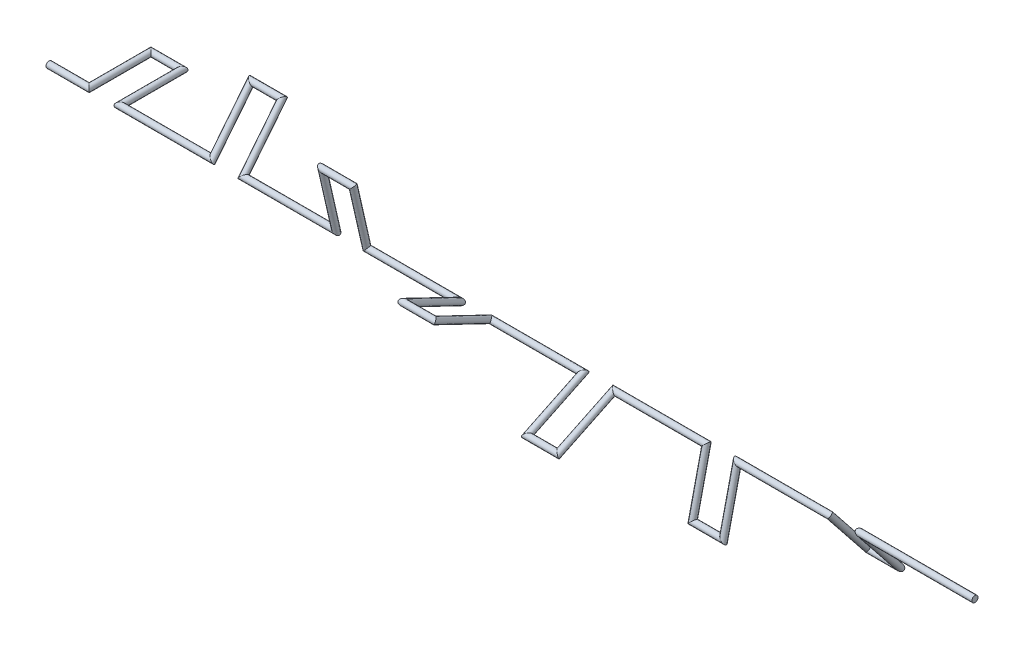
ISO-10303-21;
HEADER;
FILE_DESCRIPTION(('STEP AP214'),'2;1');
FILE_NAME('part.step','',(''),(''),'','','');
FILE_SCHEMA(('AUTOMOTIVE_DESIGN { 1 0 10303 214 1 1 1 1 }'));
ENDSEC;
DATA;
#1=APPLICATION_CONTEXT('core data for automotive mechanical design processes');
#2=APPLICATION_PROTOCOL_DEFINITION('international standard','automotive_design',2000,#1);
#3=PRODUCT_CONTEXT('',#1,'mechanical');
#4=PRODUCT('Part','Part','',(#3));
#5=PRODUCT_RELATED_PRODUCT_CATEGORY('part','',(#4));
#6=PRODUCT_DEFINITION_FORMATION('','',#4);
#7=PRODUCT_DEFINITION_CONTEXT('part definition',#1,'design');
#8=PRODUCT_DEFINITION('design','',#6,#7);
#9=PRODUCT_DEFINITION_SHAPE('','',#8);
#10=(LENGTH_UNIT() NAMED_UNIT(*) SI_UNIT(.MILLI.,.METRE.));
#11=(NAMED_UNIT(*) PLANE_ANGLE_UNIT() SI_UNIT($,.RADIAN.));
#12=(NAMED_UNIT(*) SI_UNIT($,.STERADIAN.) SOLID_ANGLE_UNIT());
#13=UNCERTAINTY_MEASURE_WITH_UNIT(LENGTH_MEASURE(1.E-05),#10,'distance_accuracy_value','');
#14=(GEOMETRIC_REPRESENTATION_CONTEXT(3) GLOBAL_UNCERTAINTY_ASSIGNED_CONTEXT((#13)) GLOBAL_UNIT_ASSIGNED_CONTEXT((#10,
#11,#12)) REPRESENTATION_CONTEXT('',''));
#15=CARTESIAN_POINT('',(0.,0.,0.));
#16=DIRECTION('',(0.,0.,1.));
#17=DIRECTION('',(1.,0.,0.));
#18=AXIS2_PLACEMENT_3D('',#15,#16,#17);
#19=CARTESIAN_POINT('',(0.,0.,0.));
#20=DIRECTION('',(1.,0.,0.));
#21=DIRECTION('',(0.,0.,-1.));
#22=AXIS2_PLACEMENT_3D('',#19,#20,#21);
#23=PLANE('',#22);
#24=CARTESIAN_POINT('',(0.,0.,0.));
#25=DIRECTION('',(1.,0.,0.));
#26=DIRECTION('',(0.,0.,-1.));
#27=AXIS2_PLACEMENT_3D('',#24,#25,#26);
#28=CIRCLE('',#27,1.);
#29=CARTESIAN_POINT('',(0.,0.,-1.));
#30=VERTEX_POINT('',#29);
#31=EDGE_CURVE('E42',#30,#30,#28,.T.);
#32=ORIENTED_EDGE('',*,*,#31,.F.);
#33=EDGE_LOOP('',(#32));
#34=FACE_BOUND('',#33,.T.);
#35=ADVANCED_FACE('F39',(#34),#23,.F.);
#36=CARTESIAN_POINT('',(300.,0.,0.));
#37=DIRECTION('',(1.,0.,0.));
#38=DIRECTION('',(0.,0.,-1.));
#39=AXIS2_PLACEMENT_3D('',#36,#37,#38);
#40=PLANE('',#39);
#41=CARTESIAN_POINT('',(300.,0.,0.));
#42=DIRECTION('',(1.,0.,0.));
#43=DIRECTION('',(0.,0.,-1.));
#44=AXIS2_PLACEMENT_3D('',#41,#42,#43);
#45=CIRCLE('',#44,1.);
#46=CARTESIAN_POINT('',(300.,0.,-0.999999999999924));
#47=VERTEX_POINT('',#46);
#48=EDGE_CURVE('E46',#47,#47,#45,.T.);
#49=ORIENTED_EDGE('',*,*,#48,.T.);
#50=EDGE_LOOP('',(#49));
#51=FACE_BOUND('',#50,.T.);
#52=ADVANCED_FACE('F140',(#51),#40,.T.);
#53=CARTESIAN_POINT('',(14.2,0.,0.));
#54=DIRECTION('',(-1.,0.,0.));
#55=DIRECTION('',(0.,0.,1.));
#56=AXIS2_PLACEMENT_3D('',#53,#54,#55);
#57=CYLINDRICAL_SURFACE('',#56,1.);
#58=CARTESIAN_POINT('',(13.,0.,0.));
#59=DIRECTION('',(-0.707106781186548,0.,0.707106781186548));
#60=DIRECTION('',(0.707106781186548,0.,0.707106781186548));
#61=AXIS2_PLACEMENT_3D('',#58,#59,#60);
#62=ELLIPSE('',#61,1.41421356237309,1.);
#63=CARTESIAN_POINT('',(14.,0.,0.999999999999997));
#64=VERTEX_POINT('',#63);
#65=EDGE_CURVE('E130',#64,#64,#62,.T.);
#66=ORIENTED_EDGE('',*,*,#65,.T.);
#67=EDGE_LOOP('',(#66));
#68=FACE_BOUND('',#67,.T.);
#69=ORIENTED_EDGE('',*,*,#31,.T.);
#70=EDGE_LOOP('',(#69));
#71=FACE_BOUND('',#70,.T.);
#72=ADVANCED_FACE('F137',(#68,#71),#57,.T.);
#73=CARTESIAN_POINT('',(13.,0.,-21.2));
#74=DIRECTION('',(0.,0.,1.));
#75=DIRECTION('',(1.,0.,0.));
#76=AXIS2_PLACEMENT_3D('',#73,#74,#75);
#77=CYLINDRICAL_SURFACE('',#76,1.);
#78=CARTESIAN_POINT('',(13.,0.,-20.));
#79=DIRECTION('',(-0.707106781186547,0.,0.707106781186547));
#80=DIRECTION('',(-0.707106781186548,0.,-0.707106781186548));
#81=AXIS2_PLACEMENT_3D('',#78,#79,#80);
#82=ELLIPSE('',#81,1.4142135623731,1.);
#83=CARTESIAN_POINT('',(12.,0.,-21.));
#84=VERTEX_POINT('',#83);
#85=EDGE_CURVE('E128',#84,#84,#82,.T.);
#86=ORIENTED_EDGE('',*,*,#85,.T.);
#87=EDGE_LOOP('',(#86));
#88=FACE_BOUND('',#87,.T.);
#89=ORIENTED_EDGE('',*,*,#65,.F.);
#90=EDGE_LOOP('',(#89));
#91=FACE_BOUND('',#90,.T.);
#92=ADVANCED_FACE('F256',(#88,#91),#77,.T.);
#93=CARTESIAN_POINT('',(24.2,0.,-20.));
#94=DIRECTION('',(-1.,0.,0.));
#95=DIRECTION('',(0.,0.,1.));
#96=AXIS2_PLACEMENT_3D('',#93,#94,#95);
#97=CYLINDRICAL_SURFACE('',#96,1.);
#98=CARTESIAN_POINT('',(23.,0.,-20.));
#99=DIRECTION('',(-0.707106781186548,0.,-0.707106781186547));
#100=DIRECTION('',(0.707106781186547,0.,-0.707106781186548));
#101=AXIS2_PLACEMENT_3D('',#98,#99,#100);
#102=ELLIPSE('',#101,1.41421356237309,1.);
#103=CARTESIAN_POINT('',(24.,0.,-21.));
#104=VERTEX_POINT('',#103);
#105=EDGE_CURVE('E125',#104,#104,#102,.T.);
#106=ORIENTED_EDGE('',*,*,#105,.T.);
#107=EDGE_LOOP('',(#106));
#108=FACE_BOUND('',#107,.T.);
#109=ORIENTED_EDGE('',*,*,#85,.F.);
#110=EDGE_LOOP('',(#109));
#111=FACE_BOUND('',#110,.T.);
#112=ADVANCED_FACE('F252',(#108,#111),#97,.T.);
#113=CARTESIAN_POINT('',(23.,0.,1.20000000000001));
#114=DIRECTION('',(0.,0.,-1.));
#115=DIRECTION('',(-1.,0.,0.));
#116=AXIS2_PLACEMENT_3D('',#113,#114,#115);
#117=CYLINDRICAL_SURFACE('',#116,1.);
#118=CARTESIAN_POINT('',(23.,0.,0.));
#119=DIRECTION('',(-0.707106781186548,0.,-0.707106781186547));
#120=DIRECTION('',(-0.707106781186547,0.,0.707106781186548));
#121=AXIS2_PLACEMENT_3D('',#118,#119,#120);
#122=ELLIPSE('',#121,1.41421356237309,1.);
#123=CARTESIAN_POINT('',(22.,0.,1.));
#124=VERTEX_POINT('',#123);
#125=EDGE_CURVE('E122',#124,#124,#122,.T.);
#126=ORIENTED_EDGE('',*,*,#125,.T.);
#127=EDGE_LOOP('',(#126));
#128=FACE_BOUND('',#127,.T.);
#129=ORIENTED_EDGE('',*,*,#105,.F.);
#130=EDGE_LOOP('',(#129));
#131=FACE_BOUND('',#130,.T.);
#132=ADVANCED_FACE('F248',(#128,#131),#117,.T.);
#133=CARTESIAN_POINT('',(55.5058680434743,0.,0.));
#134=DIRECTION('',(-1.,0.,0.));
#135=DIRECTION('',(0.,0.,1.));
#136=AXIS2_PLACEMENT_3D('',#133,#134,#135);
#137=CYLINDRICAL_SURFACE('',#136,1.);
#138=CARTESIAN_POINT('',(53.,0.,0.));
#139=DIRECTION('',(-0.707106781186547,-0.55283834299827,0.440873866894974));
#140=DIRECTION('',(0.707106781186548,-0.55283834299827,0.440873866894974));
#141=AXIS2_PLACEMENT_3D('',#138,#139,#140);
#142=ELLIPSE('',#141,1.4142135623731,1.);
#143=CARTESIAN_POINT('',(54.,-0.781831482468022,0.623489801858742));
#144=VERTEX_POINT('',#143);
#145=EDGE_CURVE('E119',#144,#144,#142,.T.);
#146=ORIENTED_EDGE('',*,*,#145,.T.);
#147=EDGE_LOOP('',(#146));
#148=FACE_BOUND('',#147,.T.);
#149=ORIENTED_EDGE('',*,*,#125,.F.);
#150=EDGE_LOOP('',(#149));
#151=FACE_BOUND('',#150,.T.);
#152=ADVANCED_FACE('F244',(#148,#151),#137,.T.);
#153=CARTESIAN_POINT('',(53.,17.5957961766592,-14.0321792070848));
#154=DIRECTION('',(0.,-0.781831482468022,0.623489801858743));
#155=DIRECTION('',(0.,-0.623489801858743,-0.781831482468022));
#156=AXIS2_PLACEMENT_3D('',#153,#154,#155);
#157=CYLINDRICAL_SURFACE('',#156,1.);
#158=CARTESIAN_POINT('',(53.,15.6366296493604,-12.4697960371749));
#159=DIRECTION('',(-0.707106781186547,-0.552838342998271,0.440873866894974));
#160=DIRECTION('',(-0.707106781186548,0.552838342998269,-0.440873866894975));
#161=AXIS2_PLACEMENT_3D('',#158,#159,#160);
#162=ELLIPSE('',#161,1.4142135623731,1.);
#163=CARTESIAN_POINT('',(52.,16.4184611318285,-13.0932858390336));
#164=VERTEX_POINT('',#163);
#165=EDGE_CURVE('E116',#164,#164,#162,.T.);
#166=ORIENTED_EDGE('',*,*,#165,.T.);
#167=EDGE_LOOP('',(#166));
#168=FACE_BOUND('',#167,.T.);
#169=ORIENTED_EDGE('',*,*,#145,.F.);
#170=EDGE_LOOP('',(#169));
#171=FACE_BOUND('',#170,.T.);
#172=ADVANCED_FACE('F240',(#168,#171),#157,.T.);
#173=CARTESIAN_POINT('',(65.5058680434743,15.6366296493605,-12.4697960371749));
#174=DIRECTION('',(-1.,0.,0.));
#175=DIRECTION('',(0.,-1.,0.));
#176=AXIS2_PLACEMENT_3D('',#173,#174,#175);
#177=CYLINDRICAL_SURFACE('',#176,1.);
#178=CARTESIAN_POINT('',(63.,15.6366296493604,-12.4697960371749));
#179=DIRECTION('',(-0.707106781186548,0.552838342998269,-0.440873866894975));
#180=DIRECTION('',(0.707106781186547,0.552838342998271,-0.440873866894973));
#181=AXIS2_PLACEMENT_3D('',#178,#179,#180);
#182=ELLIPSE('',#181,1.4142135623731,1.);
#183=CARTESIAN_POINT('',(64.,16.4184611318285,-13.0932858390336));
#184=VERTEX_POINT('',#183);
#185=EDGE_CURVE('E113',#184,#184,#182,.T.);
#186=ORIENTED_EDGE('',*,*,#185,.T.);
#187=EDGE_LOOP('',(#186));
#188=FACE_BOUND('',#187,.T.);
#189=ORIENTED_EDGE('',*,*,#165,.F.);
#190=EDGE_LOOP('',(#189));
#191=FACE_BOUND('',#190,.T.);
#192=ADVANCED_FACE('F236',(#188,#191),#177,.T.);
#193=CARTESIAN_POINT('',(63.,-1.95916652729873,1.56238316990993));
#194=DIRECTION('',(0.,0.781831482468022,-0.623489801858743));
#195=DIRECTION('',(0.,0.623489801858743,0.781831482468023));
#196=AXIS2_PLACEMENT_3D('',#193,#194,#195);
#197=CYLINDRICAL_SURFACE('',#196,1.);
#198=CARTESIAN_POINT('',(63.,0.,0.));
#199=DIRECTION('',(-0.707106781186548,0.55283834299827,-0.440873866894974));
#200=DIRECTION('',(-0.707106781186547,-0.55283834299827,0.440873866894974));
#201=AXIS2_PLACEMENT_3D('',#198,#199,#200);
#202=ELLIPSE('',#201,1.4142135623731,1.);
#203=CARTESIAN_POINT('',(62.,-0.781831482468023,0.623489801858743));
#204=VERTEX_POINT('',#203);
#205=EDGE_CURVE('E110',#204,#204,#202,.T.);
#206=ORIENTED_EDGE('',*,*,#205,.T.);
#207=EDGE_LOOP('',(#206));
#208=FACE_BOUND('',#207,.T.);
#209=ORIENTED_EDGE('',*,*,#185,.F.);
#210=EDGE_LOOP('',(#209));
#211=FACE_BOUND('',#210,.T.);
#212=ADVANCED_FACE('F232',(#208,#211),#197,.T.);
#213=CARTESIAN_POINT('',(95.4896144341519,0.,0.));
#214=DIRECTION('',(-1.,0.,0.));
#215=DIRECTION('',(0.,0.,1.));
#216=AXIS2_PLACEMENT_3D('',#213,#214,#215);
#217=CYLINDRICAL_SURFACE('',#216,1.);
#218=CARTESIAN_POINT('',(93.,0.,0.));
#219=DIRECTION('',(-0.707106781186547,-0.689378137871812,-0.157346061356467));
#220=DIRECTION('',(0.707106781186548,-0.689378137871812,-0.157346061356468));
#221=AXIS2_PLACEMENT_3D('',#218,#219,#220);
#222=ELLIPSE('',#221,1.41421356237309,1.);
#223=CARTESIAN_POINT('',(94.,-0.974927912181814,-0.222520933956317));
#224=VERTEX_POINT('',#223);
#225=EDGE_CURVE('E107',#224,#224,#222,.T.);
#226=ORIENTED_EDGE('',*,*,#225,.T.);
#227=EDGE_LOOP('',(#226));
#228=FACE_BOUND('',#227,.T.);
#229=ORIENTED_EDGE('',*,*,#205,.F.);
#230=EDGE_LOOP('',(#229));
#231=FACE_BOUND('',#230,.T.);
#232=ADVANCED_FACE('F228',(#228,#231),#217,.T.);
#233=CARTESIAN_POINT('',(93.,21.9257528460614,5.00441000820455));
#234=DIRECTION('',(0.,-0.974927912181826,-0.222520933956306));
#235=DIRECTION('',(0.,0.222520933956306,-0.974927912181826));
#236=AXIS2_PLACEMENT_3D('',#233,#234,#235);
#237=CYLINDRICAL_SURFACE('',#236,1.);
#238=CARTESIAN_POINT('',(93.,19.4985582436358,4.45041867912594));
#239=DIRECTION('',(-0.707106781186558,-0.689378137871801,-0.157346061356465));
#240=DIRECTION('',(-0.707106781186537,0.689378137871822,0.15734606135647));
#241=AXIS2_PLACEMENT_3D('',#238,#239,#240);
#242=ELLIPSE('',#241,1.41421356237312,1.);
#243=CARTESIAN_POINT('',(92.,20.4734861558177,4.67293961308226));
#244=VERTEX_POINT('',#243);
#245=EDGE_CURVE('E104',#244,#244,#242,.T.);
#246=ORIENTED_EDGE('',*,*,#245,.T.);
#247=EDGE_LOOP('',(#246));
#248=FACE_BOUND('',#247,.T.);
#249=ORIENTED_EDGE('',*,*,#225,.F.);
#250=EDGE_LOOP('',(#249));
#251=FACE_BOUND('',#250,.T.);
#252=ADVANCED_FACE('F224',(#248,#251),#237,.T.);
#253=CARTESIAN_POINT('',(105.489614434152,19.4985582436355,4.45041867912585));
#254=DIRECTION('',(-1.,0.,0.));
#255=DIRECTION('',(0.,-1.,0.));
#256=AXIS2_PLACEMENT_3D('',#253,#254,#255);
#257=CYLINDRICAL_SURFACE('',#256,1.);
#258=CARTESIAN_POINT('',(103.,19.4985582436355,4.45041867912587));
#259=DIRECTION('',(-0.707106781186536,0.689378137871823,0.157346061356469));
#260=DIRECTION('',(0.707106781186558,0.689378137871801,0.157346061356464));
#261=AXIS2_PLACEMENT_3D('',#258,#259,#260);
#262=ELLIPSE('',#261,1.41421356237307,1.);
#263=CARTESIAN_POINT('',(104.,20.4734861558173,4.67293961308217));
#264=VERTEX_POINT('',#263);
#265=EDGE_CURVE('E101',#264,#264,#262,.T.);
#266=ORIENTED_EDGE('',*,*,#265,.T.);
#267=EDGE_LOOP('',(#266));
#268=FACE_BOUND('',#267,.T.);
#269=ORIENTED_EDGE('',*,*,#245,.F.);
#270=EDGE_LOOP('',(#269));
#271=FACE_BOUND('',#270,.T.);
#272=ADVANCED_FACE('F220',(#268,#271),#257,.T.);
#273=CARTESIAN_POINT('',(103.,-2.42719460242544,-0.553991329078564));
#274=DIRECTION('',(0.,0.974927912181826,0.222520933956304));
#275=DIRECTION('',(0.,-0.222520933956305,0.974927912181826));
#276=AXIS2_PLACEMENT_3D('',#273,#274,#275);
#277=CYLINDRICAL_SURFACE('',#276,1.);
#278=CARTESIAN_POINT('',(103.,0.,0.));
#279=DIRECTION('',(-0.707106781186547,0.689378137871812,0.157346061356465));
#280=DIRECTION('',(-0.707106781186548,-0.689378137871811,-0.157346061356468));
#281=AXIS2_PLACEMENT_3D('',#278,#279,#280);
#282=ELLIPSE('',#281,1.41421356237309,1.);
#283=CARTESIAN_POINT('',(102.,-0.974927912181839,-0.2225209339563));
#284=VERTEX_POINT('',#283);
#285=EDGE_CURVE('E98',#284,#284,#282,.T.);
#286=ORIENTED_EDGE('',*,*,#285,.T.);
#287=EDGE_LOOP('',(#286));
#288=FACE_BOUND('',#287,.T.);
#289=ORIENTED_EDGE('',*,*,#265,.F.);
#290=EDGE_LOOP('',(#289));
#291=FACE_BOUND('',#290,.T.);
#292=ADVANCED_FACE('F216',(#288,#291),#277,.T.);
#293=CARTESIAN_POINT('',(135.045609980751,0.,0.));
#294=DIRECTION('',(-1.,0.,0.));
#295=DIRECTION('',(0.,0.,1.));
#296=AXIS2_PLACEMENT_3D('',#293,#294,#295);
#297=CYLINDRICAL_SURFACE('',#296,1.);
#298=CARTESIAN_POINT('',(133.,0.,0.));
#299=DIRECTION('',(-0.707106781186547,-0.306802134176605,-0.637081196131765));
#300=DIRECTION('',(0.707106781186548,-0.306802134176607,-0.637081196131763));
#301=AXIS2_PLACEMENT_3D('',#298,#299,#300);
#302=ELLIPSE('',#301,1.41421356237309,1.);
#303=CARTESIAN_POINT('',(134.,-0.433883739117609,-0.900968867902344));
#304=VERTEX_POINT('',#303);
#305=EDGE_CURVE('E95',#304,#304,#302,.T.);
#306=ORIENTED_EDGE('',*,*,#305,.T.);
#307=EDGE_LOOP('',(#306));
#308=FACE_BOUND('',#307,.T.);
#309=ORIENTED_EDGE('',*,*,#285,.F.);
#310=EDGE_LOOP('',(#309));
#311=FACE_BOUND('',#310,.T.);
#312=ADVANCED_FACE('F212',(#308,#311),#297,.T.);
#313=CARTESIAN_POINT('',(133.,9.56523168957567,19.8624082665753));
#314=DIRECTION('',(0.,-0.433883739117567,-0.900968867902415));
#315=DIRECTION('',(0.,0.900968867902415,-0.433883739117567));
#316=AXIS2_PLACEMENT_3D('',#313,#314,#315);
#317=CYLINDRICAL_SURFACE('',#316,1.);
#318=CARTESIAN_POINT('',(133.,8.67767478235108,18.0193773580479));
#319=DIRECTION('',(-0.707106781186548,-0.306802134176606,-0.637081196131765));
#320=DIRECTION('',(-0.707106781186547,0.306802134176606,0.637081196131764));
#321=AXIS2_PLACEMENT_3D('',#318,#319,#320);
#322=ELLIPSE('',#321,1.41421356237309,1.);
#323=CARTESIAN_POINT('',(132.,9.11155852146864,18.9203462259503));
#324=VERTEX_POINT('',#323);
#325=EDGE_CURVE('E92',#324,#324,#322,.T.);
#326=ORIENTED_EDGE('',*,*,#325,.T.);
#327=EDGE_LOOP('',(#326));
#328=FACE_BOUND('',#327,.T.);
#329=ORIENTED_EDGE('',*,*,#305,.F.);
#330=EDGE_LOOP('',(#329));
#331=FACE_BOUND('',#330,.T.);
#332=ADVANCED_FACE('F208',(#328,#331),#317,.T.);
#333=CARTESIAN_POINT('',(145.045609980751,8.67767478235107,18.0193773580479));
#334=DIRECTION('',(-1.,0.,0.));
#335=DIRECTION('',(0.,-1.,0.));
#336=AXIS2_PLACEMENT_3D('',#333,#334,#335);
#337=CYLINDRICAL_SURFACE('',#336,1.);
#338=CARTESIAN_POINT('',(143.,8.67767478235107,18.0193773580479));
#339=DIRECTION('',(-0.707106781186547,0.306802134176606,0.637081196131765));
#340=DIRECTION('',(0.707106781186548,0.306802134176605,0.637081196131765));
#341=AXIS2_PLACEMENT_3D('',#338,#339,#340);
#342=ELLIPSE('',#341,1.41421356237309,1.);
#343=CARTESIAN_POINT('',(144.,9.11155852146863,18.9203462259503));
#344=VERTEX_POINT('',#343);
#345=EDGE_CURVE('E89',#344,#344,#342,.T.);
#346=ORIENTED_EDGE('',*,*,#345,.T.);
#347=EDGE_LOOP('',(#346));
#348=FACE_BOUND('',#347,.T.);
#349=ORIENTED_EDGE('',*,*,#325,.F.);
#350=EDGE_LOOP('',(#349));
#351=FACE_BOUND('',#350,.T.);
#352=ADVANCED_FACE('F204',(#348,#351),#337,.T.);
#353=CARTESIAN_POINT('',(143.,-0.887556907224621,-1.84303090852737));
#354=DIRECTION('',(0.,0.433883739117565,0.900968867902416));
#355=DIRECTION('',(0.,-0.900968867902416,0.433883739117565));
#356=AXIS2_PLACEMENT_3D('',#353,#354,#355);
#357=CYLINDRICAL_SURFACE('',#356,1.);
#358=CARTESIAN_POINT('',(143.,0.,0.));
#359=DIRECTION('',(-0.707106781186547,0.306802134176605,0.637081196131765));
#360=DIRECTION('',(-0.707106781186548,-0.306802134176605,-0.637081196131764));
#361=AXIS2_PLACEMENT_3D('',#358,#359,#360);
#362=ELLIPSE('',#361,1.41421356237309,1.);
#363=CARTESIAN_POINT('',(142.,-0.433883739117586,-0.900968867902387));
#364=VERTEX_POINT('',#363);
#365=EDGE_CURVE('E86',#364,#364,#362,.T.);
#366=ORIENTED_EDGE('',*,*,#365,.T.);
#367=EDGE_LOOP('',(#366));
#368=FACE_BOUND('',#367,.T.);
#369=ORIENTED_EDGE('',*,*,#345,.F.);
#370=EDGE_LOOP('',(#369));
#371=FACE_BOUND('',#370,.T.);
#372=ADVANCED_FACE('F200',(#368,#371),#357,.T.);
#373=CARTESIAN_POINT('',(175.045609980751,0.,0.));
#374=DIRECTION('',(-1.,0.,0.));
#375=DIRECTION('',(0.,0.,1.));
#376=AXIS2_PLACEMENT_3D('',#373,#374,#375);
#377=CYLINDRICAL_SURFACE('',#376,1.);
#378=CARTESIAN_POINT('',(173.,0.,0.));
#379=DIRECTION('',(-0.707106781186548,0.306802134176597,-0.637081196131769));
#380=DIRECTION('',(0.707106781186547,0.306802134176596,-0.63708119613177));
#381=AXIS2_PLACEMENT_3D('',#378,#379,#380);
#382=ELLIPSE('',#381,1.4142135623731,1.);
#383=CARTESIAN_POINT('',(174.,0.43388373911756,-0.900968867902444));
#384=VERTEX_POINT('',#383);
#385=EDGE_CURVE('E83',#384,#384,#382,.T.);
#386=ORIENTED_EDGE('',*,*,#385,.T.);
#387=EDGE_LOOP('',(#386));
#388=FACE_BOUND('',#387,.T.);
#389=ORIENTED_EDGE('',*,*,#365,.F.);
#390=EDGE_LOOP('',(#389));
#391=FACE_BOUND('',#390,.T.);
#392=ADVANCED_FACE('F196',(#388,#391),#377,.T.);
#393=CARTESIAN_POINT('',(173.,-9.56523168957515,19.8624082665749));
#394=DIRECTION('',(0.,0.433883739117553,-0.900968867902422));
#395=DIRECTION('',(0.,0.900968867902422,0.433883739117553));
#396=AXIS2_PLACEMENT_3D('',#393,#394,#395);
#397=CYLINDRICAL_SURFACE('',#396,1.);
#398=CARTESIAN_POINT('',(173.,-8.67767478235062,18.0193773580475));
#399=DIRECTION('',(-0.707106781186548,0.306802134176596,-0.637081196131769));
#400=DIRECTION('',(-0.707106781186547,-0.306802134176596,0.637081196131769));
#401=AXIS2_PLACEMENT_3D('',#398,#399,#400);
#402=ELLIPSE('',#401,1.4142135623731,1.);
#403=CARTESIAN_POINT('',(172.,-9.11155852146818,18.9203462259499));
#404=VERTEX_POINT('',#403);
#405=EDGE_CURVE('E80',#404,#404,#402,.T.);
#406=ORIENTED_EDGE('',*,*,#405,.T.);
#407=EDGE_LOOP('',(#406));
#408=FACE_BOUND('',#407,.T.);
#409=ORIENTED_EDGE('',*,*,#385,.F.);
#410=EDGE_LOOP('',(#409));
#411=FACE_BOUND('',#410,.T.);
#412=ADVANCED_FACE('F192',(#408,#411),#397,.T.);
#413=CARTESIAN_POINT('',(185.045609980751,-8.67767478235062,18.0193773580475));
#414=DIRECTION('',(-1.,0.,0.));
#415=DIRECTION('',(0.,0.,1.));
#416=AXIS2_PLACEMENT_3D('',#413,#414,#415);
#417=CYLINDRICAL_SURFACE('',#416,1.);
#418=CARTESIAN_POINT('',(183.,-8.67767478235065,18.0193773580475));
#419=DIRECTION('',(-0.707106781186547,-0.306802134176597,0.63708119613177));
#420=DIRECTION('',(0.707106781186548,-0.306802134176597,0.637081196131768));
#421=AXIS2_PLACEMENT_3D('',#418,#419,#420);
#422=ELLIPSE('',#421,1.4142135623731,1.);
#423=CARTESIAN_POINT('',(184.,-9.1115585214682,18.9203462259499));
#424=VERTEX_POINT('',#423);
#425=EDGE_CURVE('E77',#424,#424,#422,.T.);
#426=ORIENTED_EDGE('',*,*,#425,.T.);
#427=EDGE_LOOP('',(#426));
#428=FACE_BOUND('',#427,.T.);
#429=ORIENTED_EDGE('',*,*,#405,.F.);
#430=EDGE_LOOP('',(#429));
#431=FACE_BOUND('',#430,.T.);
#432=ADVANCED_FACE('F188',(#428,#431),#417,.T.);
#433=CARTESIAN_POINT('',(183.,0.887556907224539,-1.84303090852739));
#434=DIRECTION('',(0.,-0.433883739117554,0.900968867902421));
#435=DIRECTION('',(0.,-0.900968867902421,-0.433883739117554));
#436=AXIS2_PLACEMENT_3D('',#433,#434,#435);
#437=CYLINDRICAL_SURFACE('',#436,1.);
#438=CARTESIAN_POINT('',(183.,0.,0.));
#439=DIRECTION('',(-0.707106781186547,-0.306802134176597,0.63708119613177));
#440=DIRECTION('',(-0.707106781186548,0.306802134176597,-0.637081196131768));
#441=AXIS2_PLACEMENT_3D('',#438,#439,#440);
#442=ELLIPSE('',#441,1.4142135623731,1.);
#443=CARTESIAN_POINT('',(182.,0.433883739117555,-0.900968867902421));
#444=VERTEX_POINT('',#443);
#445=EDGE_CURVE('E74',#444,#444,#442,.T.);
#446=ORIENTED_EDGE('',*,*,#445,.T.);
#447=EDGE_LOOP('',(#446));
#448=FACE_BOUND('',#447,.T.);
#449=ORIENTED_EDGE('',*,*,#425,.F.);
#450=EDGE_LOOP('',(#449));
#451=FACE_BOUND('',#450,.T.);
#452=ADVANCED_FACE('F184',(#448,#451),#437,.T.);
#453=CARTESIAN_POINT('',(215.489614434152,0.,0.));
#454=DIRECTION('',(-1.,0.,0.));
#455=DIRECTION('',(0.,0.,1.));
#456=AXIS2_PLACEMENT_3D('',#453,#454,#455);
#457=CYLINDRICAL_SURFACE('',#456,1.);
#458=CARTESIAN_POINT('',(213.,0.,0.));
#459=DIRECTION('',(-0.707106781186547,0.689378137871811,-0.157346061356476));
#460=DIRECTION('',(0.707106781186548,0.689378137871809,-0.157346061356477));
#461=AXIS2_PLACEMENT_3D('',#458,#459,#460);
#462=ELLIPSE('',#461,1.4142135623731,1.);
#463=CARTESIAN_POINT('',(214.,0.974927912181822,-0.22252093395635));
#464=VERTEX_POINT('',#463);
#465=EDGE_CURVE('E71',#464,#464,#462,.T.);
#466=ORIENTED_EDGE('',*,*,#465,.T.);
#467=EDGE_LOOP('',(#466));
#468=FACE_BOUND('',#467,.T.);
#469=ORIENTED_EDGE('',*,*,#445,.F.);
#470=EDGE_LOOP('',(#469));
#471=FACE_BOUND('',#470,.T.);
#472=ADVANCED_FACE('F180',(#468,#471),#457,.T.);
#473=CARTESIAN_POINT('',(213.,-21.9257528460609,5.00441000820472));
#474=DIRECTION('',(0.,0.974927912181823,-0.222520933956318));
#475=DIRECTION('',(0.,0.222520933956318,0.974927912181823));
#476=AXIS2_PLACEMENT_3D('',#473,#474,#475);
#477=CYLINDRICAL_SURFACE('',#476,1.);
#478=CARTESIAN_POINT('',(213.,-19.4985582436354,4.45041867912609));
#479=DIRECTION('',(-0.707106781186546,0.689378137871811,-0.157346061356477));
#480=DIRECTION('',(-0.707106781186549,-0.689378137871809,0.157346061356476));
#481=AXIS2_PLACEMENT_3D('',#478,#479,#480);
#482=ELLIPSE('',#481,1.41421356237309,1.);
#483=CARTESIAN_POINT('',(212.,-20.4734861558172,4.67293961308241));
#484=VERTEX_POINT('',#483);
#485=EDGE_CURVE('E68',#484,#484,#482,.T.);
#486=ORIENTED_EDGE('',*,*,#485,.T.);
#487=EDGE_LOOP('',(#486));
#488=FACE_BOUND('',#487,.T.);
#489=ORIENTED_EDGE('',*,*,#465,.F.);
#490=EDGE_LOOP('',(#489));
#491=FACE_BOUND('',#490,.T.);
#492=ADVANCED_FACE('F176',(#488,#491),#477,.T.);
#493=CARTESIAN_POINT('',(225.489614434152,-19.4985582436354,4.4504186791261));
#494=DIRECTION('',(-1.,0.,0.));
#495=DIRECTION('',(0.,-1.,0.));
#496=AXIS2_PLACEMENT_3D('',#493,#494,#495);
#497=CYLINDRICAL_SURFACE('',#496,1.);
#498=CARTESIAN_POINT('',(223.,-19.4985582436354,4.45041867912611));
#499=DIRECTION('',(-0.707106781186548,-0.689378137871809,0.157346061356475));
#500=DIRECTION('',(0.707106781186547,-0.68937813787181,0.157346061356476));
#501=AXIS2_PLACEMENT_3D('',#498,#499,#500);
#502=ELLIPSE('',#501,1.4142135623731,1.);
#503=CARTESIAN_POINT('',(224.,-20.4734861558173,4.67293961308243));
#504=VERTEX_POINT('',#503);
#505=EDGE_CURVE('E65',#504,#504,#502,.T.);
#506=ORIENTED_EDGE('',*,*,#505,.T.);
#507=EDGE_LOOP('',(#506));
#508=FACE_BOUND('',#507,.T.);
#509=ORIENTED_EDGE('',*,*,#485,.F.);
#510=EDGE_LOOP('',(#509));
#511=FACE_BOUND('',#510,.T.);
#512=ADVANCED_FACE('F172',(#508,#511),#497,.T.);
#513=CARTESIAN_POINT('',(223.,2.42719460242553,-0.553991329078625));
#514=DIRECTION('',(0.,-0.974927912181823,0.222520933956317));
#515=DIRECTION('',(0.,-0.222520933956317,-0.974927912181823));
#516=AXIS2_PLACEMENT_3D('',#513,#514,#515);
#517=CYLINDRICAL_SURFACE('',#516,1.);
#518=CARTESIAN_POINT('',(223.,0.,0.));
#519=DIRECTION('',(-0.707106781186547,-0.68937813787181,0.157346061356475));
#520=DIRECTION('',(-0.707106781186548,0.68937813787181,-0.157346061356476));
#521=AXIS2_PLACEMENT_3D('',#518,#519,#520);
#522=ELLIPSE('',#521,1.4142135623731,1.);
#523=CARTESIAN_POINT('',(222.,0.974927912181851,-0.222520933956324));
#524=VERTEX_POINT('',#523);
#525=EDGE_CURVE('E62',#524,#524,#522,.T.);
#526=ORIENTED_EDGE('',*,*,#525,.T.);
#527=EDGE_LOOP('',(#526));
#528=FACE_BOUND('',#527,.T.);
#529=ORIENTED_EDGE('',*,*,#505,.F.);
#530=EDGE_LOOP('',(#529));
#531=FACE_BOUND('',#530,.T.);
#532=ADVANCED_FACE('F168',(#528,#531),#517,.T.);
#533=CARTESIAN_POINT('',(255.505868043474,0.,0.));
#534=DIRECTION('',(-1.,0.,0.));
#535=DIRECTION('',(0.,0.,1.));
#536=AXIS2_PLACEMENT_3D('',#533,#534,#535);
#537=CYLINDRICAL_SURFACE('',#536,1.);
#538=CARTESIAN_POINT('',(253.,0.,0.));
#539=DIRECTION('',(-0.707106781186547,0.552838342998277,0.440873866894967));
#540=DIRECTION('',(0.707106781186548,0.552838342998275,0.440873866894966));
#541=AXIS2_PLACEMENT_3D('',#538,#539,#540);
#542=ELLIPSE('',#541,1.4142135623731,1.);
#543=CARTESIAN_POINT('',(254.,0.78183148246809,0.62348980185876));
#544=VERTEX_POINT('',#543);
#545=EDGE_CURVE('E59',#544,#544,#542,.T.);
#546=ORIENTED_EDGE('',*,*,#545,.T.);
#547=EDGE_LOOP('',(#546));
#548=FACE_BOUND('',#547,.T.);
#549=ORIENTED_EDGE('',*,*,#525,.F.);
#550=EDGE_LOOP('',(#549));
#551=FACE_BOUND('',#550,.T.);
#552=ADVANCED_FACE('F164',(#548,#551),#537,.T.);
#553=CARTESIAN_POINT('',(253.,-17.5957961766585,-14.0321792070839));
#554=DIRECTION('',(0.,0.781831482468031,0.623489801858732));
#555=DIRECTION('',(0.,-0.623489801858732,0.781831482468031));
#556=AXIS2_PLACEMENT_3D('',#553,#554,#555);
#557=CYLINDRICAL_SURFACE('',#556,1.);
#558=CARTESIAN_POINT('',(253.,-15.6366296493598,-12.469796037174));
#559=DIRECTION('',(-0.707106781186546,0.552838342998277,0.440873866894967));
#560=DIRECTION('',(-0.707106781186549,-0.552838342998275,-0.440873866894966));
#561=AXIS2_PLACEMENT_3D('',#558,#559,#560);
#562=ELLIPSE('',#561,1.4142135623731,1.);
#563=CARTESIAN_POINT('',(252.,-16.4184611318278,-13.0932858390327));
#564=VERTEX_POINT('',#563);
#565=EDGE_CURVE('E56',#564,#564,#562,.T.);
#566=ORIENTED_EDGE('',*,*,#565,.T.);
#567=EDGE_LOOP('',(#566));
#568=FACE_BOUND('',#567,.T.);
#569=ORIENTED_EDGE('',*,*,#545,.F.);
#570=EDGE_LOOP('',(#569));
#571=FACE_BOUND('',#570,.T.);
#572=ADVANCED_FACE('F160',(#568,#571),#557,.T.);
#573=CARTESIAN_POINT('',(265.505868043474,-15.6366296493598,-12.469796037174));
#574=DIRECTION('',(-1.,0.,0.));
#575=DIRECTION('',(0.,-1.,0.));
#576=AXIS2_PLACEMENT_3D('',#573,#574,#575);
#577=CYLINDRICAL_SURFACE('',#576,1.);
#578=CARTESIAN_POINT('',(263.,-15.6366296493598,-12.469796037174));
#579=DIRECTION('',(-0.707106781186548,-0.552838342998276,-0.440873866894966));
#580=DIRECTION('',(0.707106781186547,-0.552838342998276,-0.440873866894966));
#581=AXIS2_PLACEMENT_3D('',#578,#579,#580);
#582=ELLIPSE('',#581,1.4142135623731,1.);
#583=CARTESIAN_POINT('',(264.,-16.4184611318278,-13.0932858390327));
#584=VERTEX_POINT('',#583);
#585=EDGE_CURVE('E51',#584,#584,#582,.T.);
#586=ORIENTED_EDGE('',*,*,#585,.T.);
#587=EDGE_LOOP('',(#586));
#588=FACE_BOUND('',#587,.T.);
#589=ORIENTED_EDGE('',*,*,#565,.F.);
#590=EDGE_LOOP('',(#589));
#591=FACE_BOUND('',#590,.T.);
#592=ADVANCED_FACE('F153',(#588,#591),#577,.T.);
#593=CARTESIAN_POINT('',(263.,1.95916652729881,1.56238316990997));
#594=DIRECTION('',(0.,-0.781831482468031,-0.623489801858732));
#595=DIRECTION('',(0.,0.623489801858732,-0.781831482468031));
#596=AXIS2_PLACEMENT_3D('',#593,#594,#595);
#597=CYLINDRICAL_SURFACE('',#596,1.);
#598=CARTESIAN_POINT('',(263.,0.,0.));
#599=DIRECTION('',(-0.707106781186548,-0.552838342998276,-0.440873866894966));
#600=DIRECTION('',(-0.707106781186547,0.552838342998276,0.440873866894966));
#601=AXIS2_PLACEMENT_3D('',#598,#599,#600);
#602=ELLIPSE('',#601,1.4142135623731,1.);
#603=CARTESIAN_POINT('',(262.,0.781831482468087,0.623489801858816));
#604=VERTEX_POINT('',#603);
#605=EDGE_CURVE('E10',#604,#604,#602,.T.);
#606=ORIENTED_EDGE('',*,*,#605,.T.);
#607=EDGE_LOOP('',(#606));
#608=FACE_BOUND('',#607,.T.);
#609=ORIENTED_EDGE('',*,*,#585,.F.);
#610=EDGE_LOOP('',(#609));
#611=FACE_BOUND('',#610,.T.);
#612=ADVANCED_FACE('F147',(#608,#611),#597,.T.);
#613=CARTESIAN_POINT('',(300.,0.,0.));
#614=DIRECTION('',(-1.,0.,0.));
#615=DIRECTION('',(0.,0.,1.));
#616=AXIS2_PLACEMENT_3D('',#613,#614,#615);
#617=CYLINDRICAL_SURFACE('',#616,1.);
#618=ORIENTED_EDGE('',*,*,#48,.F.);
#619=EDGE_LOOP('',(#618));
#620=FACE_BOUND('',#619,.T.);
#621=ORIENTED_EDGE('',*,*,#605,.F.);
#622=EDGE_LOOP('',(#621));
#623=FACE_BOUND('',#622,.T.);
#624=ADVANCED_FACE('F145',(#620,#623),#617,.T.);
#625=CLOSED_SHELL('',(#35,#52,#72,#92,#112,#132,#152,#172,#192,#212,#232,#252,#272,#292,#312,
#332,#352,#372,#392,#412,#432,#452,#472,#492,#512,#532,#552,#572,#592,#612,#624));
#626=MANIFOLD_SOLID_BREP('B2',#625);
#627=ADVANCED_BREP_SHAPE_REPRESENTATION('',(#18,#626),#14);
#628=SHAPE_DEFINITION_REPRESENTATION(#9,#627);
ENDSEC;
END-ISO-10303-21;
